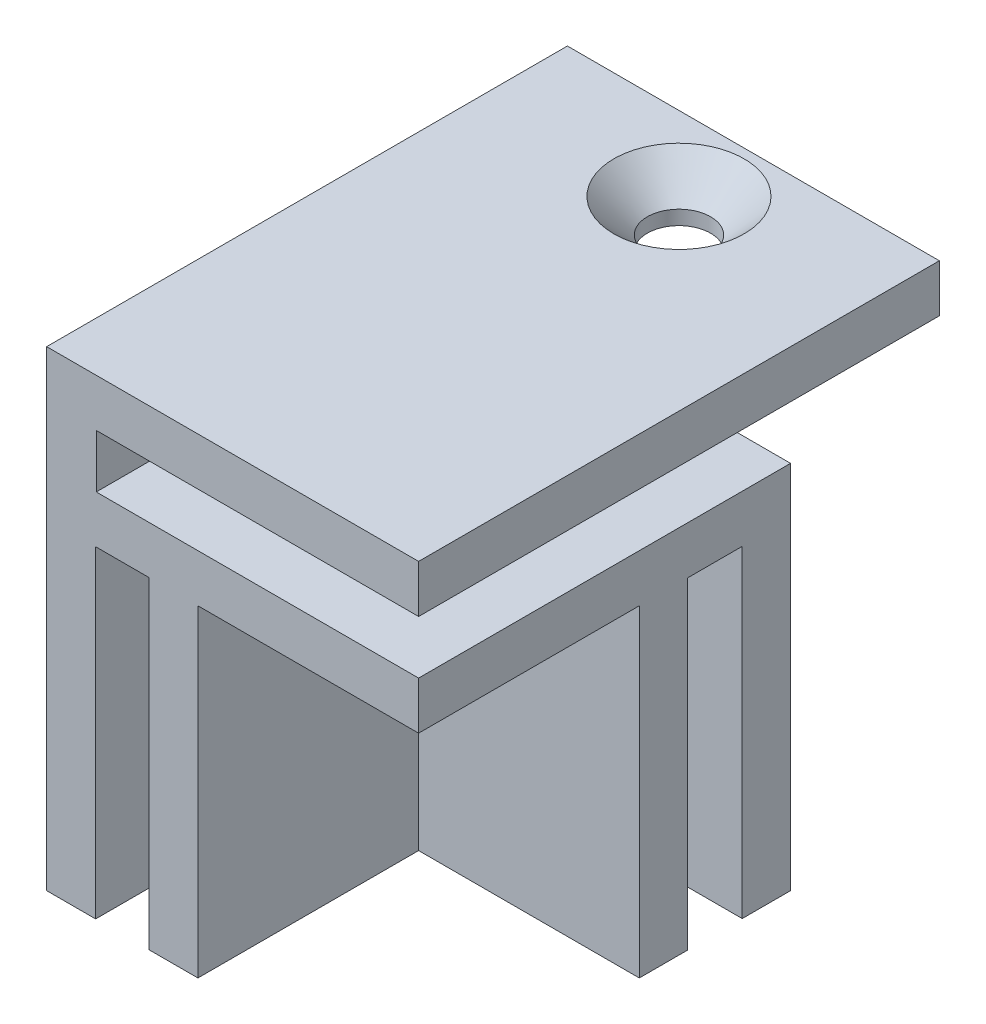
ISO-10303-21;
HEADER;
FILE_DESCRIPTION(('STEP AP214'),'2;1');
FILE_NAME('part.step','',(''),(''),'','','');
FILE_SCHEMA(('AUTOMOTIVE_DESIGN { 1 0 10303 214 1 1 1 1 }'));
ENDSEC;
DATA;
#1=APPLICATION_CONTEXT('core data for automotive mechanical design processes');
#2=APPLICATION_PROTOCOL_DEFINITION('international standard','automotive_design',2000,#1);
#3=PRODUCT_CONTEXT('',#1,'mechanical');
#4=PRODUCT('Part','Part','',(#3));
#5=PRODUCT_RELATED_PRODUCT_CATEGORY('part','',(#4));
#6=PRODUCT_DEFINITION_FORMATION('','',#4);
#7=PRODUCT_DEFINITION_CONTEXT('part definition',#1,'design');
#8=PRODUCT_DEFINITION('design','',#6,#7);
#9=PRODUCT_DEFINITION_SHAPE('','',#8);
#10=(LENGTH_UNIT() NAMED_UNIT(*) SI_UNIT(.MILLI.,.METRE.));
#11=(NAMED_UNIT(*) PLANE_ANGLE_UNIT() SI_UNIT($,.RADIAN.));
#12=(NAMED_UNIT(*) SI_UNIT($,.STERADIAN.) SOLID_ANGLE_UNIT());
#13=UNCERTAINTY_MEASURE_WITH_UNIT(LENGTH_MEASURE(1.E-05),#10,'distance_accuracy_value','');
#14=(GEOMETRIC_REPRESENTATION_CONTEXT(3) GLOBAL_UNCERTAINTY_ASSIGNED_CONTEXT((#13)) GLOBAL_UNIT_ASSIGNED_CONTEXT((#10,
#11,#12)) REPRESENTATION_CONTEXT('',''));
#15=CARTESIAN_POINT('',(0.,0.,0.));
#16=DIRECTION('',(0.,0.,1.));
#17=DIRECTION('',(1.,0.,0.));
#18=AXIS2_PLACEMENT_3D('',#15,#16,#17);
#19=CARTESIAN_POINT('',(-35.886738322403,38.,-13.5314685314684));
#20=DIRECTION('',(0.,0.,1.));
#21=DIRECTION('',(1.,0.,0.));
#22=AXIS2_PLACEMENT_3D('',#19,#20,#21);
#23=PLANE('',#22);
#24=DIRECTION('',(-1.,0.,0.));
#25=VECTOR('',#24,1.);
#26=CARTESIAN_POINT('',(-5.88673832240304,34.1499999999999,-13.5314685314684));
#27=LINE('',#26,#25);
#28=CARTESIAN_POINT('',(-31.886738322403,34.15,-13.5314685314684));
#29=VERTEX_POINT('',#28);
#30=CARTESIAN_POINT('',(-35.886738322403,34.1499999999999,-13.5314685314684));
#31=VERTEX_POINT('',#30);
#32=EDGE_CURVE('E11',#29,#31,#27,.T.);
#33=ORIENTED_EDGE('',*,*,#32,.F.);
#34=DIRECTION('',(0.,-1.,0.));
#35=VECTOR('',#34,1.);
#36=CARTESIAN_POINT('',(-31.886738322403,34.15,-13.5314685314684));
#37=LINE('',#36,#35);
#38=CARTESIAN_POINT('',(-31.886738322403,29.85,-13.5314685314684));
#39=VERTEX_POINT('',#38);
#40=EDGE_CURVE('E225',#29,#39,#37,.T.);
#41=ORIENTED_EDGE('',*,*,#40,.T.);
#42=DIRECTION('',(1.,0.,0.));
#43=VECTOR('',#42,1.);
#44=CARTESIAN_POINT('',(-31.886738322403,29.85,-13.5314685314684));
#45=LINE('',#44,#43);
#46=CARTESIAN_POINT('',(-5.88673832240304,29.85,-13.5314685314684));
#47=VERTEX_POINT('',#46);
#48=EDGE_CURVE('E229',#39,#47,#45,.T.);
#49=ORIENTED_EDGE('',*,*,#48,.T.);
#50=DIRECTION('',(0.,-1.,0.));
#51=VECTOR('',#50,1.);
#52=CARTESIAN_POINT('',(-5.88673832240304,38.,-13.5314685314684));
#53=LINE('',#52,#51);
#54=CARTESIAN_POINT('',(-5.88673832240304,0.,-13.5314685314684));
#55=VERTEX_POINT('',#54);
#56=EDGE_CURVE('E390',#47,#55,#53,.T.);
#57=ORIENTED_EDGE('',*,*,#56,.T.);
#58=DIRECTION('',(-1.,0.,0.));
#59=VECTOR('',#58,1.);
#60=CARTESIAN_POINT('',(-35.886738322403,0.,-13.5314685314684));
#61=LINE('',#60,#59);
#62=CARTESIAN_POINT('',(-35.886738322403,0.,-13.5314685314684));
#63=VERTEX_POINT('',#62);
#64=EDGE_CURVE('E365',#55,#63,#61,.T.);
#65=ORIENTED_EDGE('',*,*,#64,.T.);
#66=DIRECTION('',(0.,-1.,0.));
#67=VECTOR('',#66,1.);
#68=CARTESIAN_POINT('',(-35.886738322403,38.,-13.5314685314684));
#69=LINE('',#68,#67);
#70=EDGE_CURVE('E371',#31,#63,#69,.T.);
#71=ORIENTED_EDGE('',*,*,#70,.F.);
#72=EDGE_LOOP('',(#33,#41,#49,#57,#65,#71));
#73=FACE_BOUND('',#72,.T.);
#74=ADVANCED_FACE('F39',(#73),#23,.F.);
#75=CARTESIAN_POINT('',(-5.88673832240304,38.,-13.5314685314684));
#76=DIRECTION('',(-1.,0.,0.));
#77=DIRECTION('',(0.,0.,1.));
#78=AXIS2_PLACEMENT_3D('',#75,#76,#77);
#79=PLANE('',#78);
#80=DIRECTION('',(0.,-1.,0.));
#81=VECTOR('',#80,1.);
#82=CARTESIAN_POINT('',(-5.88673832240304,38.,16.4685314685316));
#83=LINE('',#82,#81);
#84=CARTESIAN_POINT('',(-5.88673832240304,38.,16.4685314685316));
#85=VERTEX_POINT('',#84);
#86=CARTESIAN_POINT('',(-5.88673832240304,34.15,16.4685314685316));
#87=VERTEX_POINT('',#86);
#88=EDGE_CURVE('E188',#85,#87,#83,.T.);
#89=ORIENTED_EDGE('',*,*,#88,.T.);
#90=DIRECTION('',(0.,0.,1.));
#91=VECTOR('',#90,1.);
#92=CARTESIAN_POINT('',(-5.88673832240304,34.15,-13.5314685314684));
#93=LINE('',#92,#91);
#94=CARTESIAN_POINT('',(-5.88673832240304,34.1499999999999,-25.5314685314684));
#95=VERTEX_POINT('',#94);
#96=EDGE_CURVE('E181',#95,#87,#93,.T.);
#97=ORIENTED_EDGE('',*,*,#96,.F.);
#98=DIRECTION('',(0.,-1.,0.));
#99=VECTOR('',#98,1.);
#100=CARTESIAN_POINT('',(-5.88673832240304,38.,-25.5314685314684));
#101=LINE('',#100,#99);
#102=CARTESIAN_POINT('',(-5.88673832240304,38.,-25.5314685314684));
#103=VERTEX_POINT('',#102);
#104=EDGE_CURVE('E186',#103,#95,#101,.T.);
#105=ORIENTED_EDGE('',*,*,#104,.F.);
#106=DIRECTION('',(0.,0.,-1.));
#107=VECTOR('',#106,1.);
#108=CARTESIAN_POINT('',(-5.88673832240304,38.,-13.5314685314684));
#109=LINE('',#108,#107);
#110=EDGE_CURVE('E368',#85,#103,#109,.T.);
#111=ORIENTED_EDGE('',*,*,#110,.F.);
#112=EDGE_LOOP('',(#89,#97,#105,#111));
#113=FACE_BOUND('',#112,.T.);
#114=ADVANCED_FACE('F183',(#113),#79,.F.);
#115=CARTESIAN_POINT('',(-35.886738322403,38.,-13.5314685314684));
#116=DIRECTION('',(1.,0.,0.));
#117=DIRECTION('',(0.,0.,-1.));
#118=AXIS2_PLACEMENT_3D('',#115,#116,#117);
#119=PLANE('',#118);
#120=DIRECTION('',(0.,0.,1.));
#121=VECTOR('',#120,1.);
#122=CARTESIAN_POINT('',(-35.886738322403,0.,-13.5314685314684));
#123=LINE('',#122,#121);
#124=CARTESIAN_POINT('',(-35.886738322403,0.,16.4685314685316));
#125=VERTEX_POINT('',#124);
#126=EDGE_CURVE('E282',#63,#125,#123,.T.);
#127=ORIENTED_EDGE('',*,*,#126,.T.);
#128=DIRECTION('',(0.,-1.,0.));
#129=VECTOR('',#128,1.);
#130=CARTESIAN_POINT('',(-35.886738322403,38.,16.4685314685316));
#131=LINE('',#130,#129);
#132=CARTESIAN_POINT('',(-35.886738322403,38.,16.4685314685316));
#133=VERTEX_POINT('',#132);
#134=EDGE_CURVE('E49',#133,#125,#131,.T.);
#135=ORIENTED_EDGE('',*,*,#134,.F.);
#136=DIRECTION('',(0.,0.,1.));
#137=VECTOR('',#136,1.);
#138=CARTESIAN_POINT('',(-35.886738322403,38.,-13.5314685314684));
#139=LINE('',#138,#137);
#140=CARTESIAN_POINT('',(-35.886738322403,38.,-25.5314685314684));
#141=VERTEX_POINT('',#140);
#142=EDGE_CURVE('E360',#141,#133,#139,.T.);
#143=ORIENTED_EDGE('',*,*,#142,.F.);
#144=DIRECTION('',(0.,1.,0.));
#145=VECTOR('',#144,1.);
#146=CARTESIAN_POINT('',(-35.886738322403,38.,-25.5314685314684));
#147=LINE('',#146,#145);
#148=CARTESIAN_POINT('',(-35.886738322403,34.1499999999999,-25.5314685314684));
#149=VERTEX_POINT('',#148);
#150=EDGE_CURVE('E204',#149,#141,#147,.T.);
#151=ORIENTED_EDGE('',*,*,#150,.F.);
#152=DIRECTION('',(0.,0.,1.));
#153=VECTOR('',#152,1.);
#154=CARTESIAN_POINT('',(-35.886738322403,34.1499999999999,-25.5314685314684));
#155=LINE('',#154,#153);
#156=EDGE_CURVE('E199',#149,#31,#155,.T.);
#157=ORIENTED_EDGE('',*,*,#156,.T.);
#158=ORIENTED_EDGE('',*,*,#70,.T.);
#159=EDGE_LOOP('',(#127,#135,#143,#151,#157,#158));
#160=FACE_BOUND('',#159,.T.);
#161=ADVANCED_FACE('F41',(#160),#119,.F.);
#162=CARTESIAN_POINT('',(-35.886738322403,38.,16.4685314685316));
#163=DIRECTION('',(0.,0.,-1.));
#164=DIRECTION('',(-1.,0.,0.));
#165=AXIS2_PLACEMENT_3D('',#162,#163,#164);
#166=PLANE('',#165);
#167=DIRECTION('',(0.,-1.,0.));
#168=VECTOR('',#167,1.);
#169=CARTESIAN_POINT('',(-31.886738322403,34.15,16.4685314685316));
#170=LINE('',#169,#168);
#171=CARTESIAN_POINT('',(-31.886738322403,34.15,16.4685314685316));
#172=VERTEX_POINT('',#171);
#173=CARTESIAN_POINT('',(-31.886738322403,29.85,16.4685314685316));
#174=VERTEX_POINT('',#173);
#175=EDGE_CURVE('E224',#172,#174,#170,.T.);
#176=ORIENTED_EDGE('',*,*,#175,.F.);
#177=DIRECTION('',(-1.,0.,0.));
#178=VECTOR('',#177,1.);
#179=CARTESIAN_POINT('',(-31.886738322403,34.15,16.4685314685316));
#180=LINE('',#179,#178);
#181=EDGE_CURVE('E230',#87,#172,#180,.T.);
#182=ORIENTED_EDGE('',*,*,#181,.F.);
#183=ORIENTED_EDGE('',*,*,#88,.F.);
#184=DIRECTION('',(1.,0.,0.));
#185=VECTOR('',#184,1.);
#186=CARTESIAN_POINT('',(-35.886738322403,38.,16.4685314685316));
#187=LINE('',#186,#185);
#188=EDGE_CURVE('E364',#133,#85,#187,.T.);
#189=ORIENTED_EDGE('',*,*,#188,.F.);
#190=ORIENTED_EDGE('',*,*,#134,.T.);
#191=DIRECTION('',(1.,0.,0.));
#192=VECTOR('',#191,1.);
#193=CARTESIAN_POINT('',(-35.886738322403,0.,16.4685314685316));
#194=LINE('',#193,#192);
#195=CARTESIAN_POINT('',(-31.936738322403,0.,16.4685314685316));
#196=VERTEX_POINT('',#195);
#197=EDGE_CURVE('E376',#125,#196,#194,.T.);
#198=ORIENTED_EDGE('',*,*,#197,.T.);
#199=DIRECTION('',(0.,-1.,0.));
#200=VECTOR('',#199,1.);
#201=CARTESIAN_POINT('',(-31.936738322403,26.,16.4685314685316));
#202=LINE('',#201,#200);
#203=CARTESIAN_POINT('',(-31.936738322403,26.,16.4685314685316));
#204=VERTEX_POINT('',#203);
#205=EDGE_CURVE('E325',#204,#196,#202,.T.);
#206=ORIENTED_EDGE('',*,*,#205,.F.);
#207=DIRECTION('',(-1.,0.,0.));
#208=VECTOR('',#207,1.);
#209=CARTESIAN_POINT('',(-27.6367383224031,26.,16.4685314685316));
#210=LINE('',#209,#208);
#211=CARTESIAN_POINT('',(-27.6367383224031,26.,16.4685314685316));
#212=VERTEX_POINT('',#211);
#213=EDGE_CURVE('E295',#212,#204,#210,.T.);
#214=ORIENTED_EDGE('',*,*,#213,.F.);
#215=DIRECTION('',(0.,-1.,0.));
#216=VECTOR('',#215,1.);
#217=CARTESIAN_POINT('',(-27.6367383224031,26.,16.4685314685316));
#218=LINE('',#217,#216);
#219=CARTESIAN_POINT('',(-27.6367383224031,0.,16.4685314685316));
#220=VERTEX_POINT('',#219);
#221=EDGE_CURVE('E308',#212,#220,#218,.T.);
#222=ORIENTED_EDGE('',*,*,#221,.T.);
#223=CARTESIAN_POINT('',(-23.686738322403,0.,16.4685314685316));
#224=VERTEX_POINT('',#223);
#225=EDGE_CURVE('E375',#220,#224,#194,.T.);
#226=ORIENTED_EDGE('',*,*,#225,.T.);
#227=DIRECTION('',(0.,-1.,0.));
#228=VECTOR('',#227,1.);
#229=CARTESIAN_POINT('',(-23.686738322403,26.,16.4685314685316));
#230=LINE('',#229,#228);
#231=CARTESIAN_POINT('',(-23.686738322403,26.,16.4685314685316));
#232=VERTEX_POINT('',#231);
#233=EDGE_CURVE('E65',#232,#224,#230,.T.);
#234=ORIENTED_EDGE('',*,*,#233,.F.);
#235=DIRECTION('',(-1.,0.,0.));
#236=VECTOR('',#235,1.);
#237=CARTESIAN_POINT('',(-5.88673832240304,26.,16.4685314685316));
#238=LINE('',#237,#236);
#239=CARTESIAN_POINT('',(-5.88673832240304,26.,16.4685314685316));
#240=VERTEX_POINT('',#239);
#241=EDGE_CURVE('E335',#240,#232,#238,.T.);
#242=ORIENTED_EDGE('',*,*,#241,.F.);
#243=CARTESIAN_POINT('',(-5.88673832240304,29.85,16.4685314685316));
#244=VERTEX_POINT('',#243);
#245=EDGE_CURVE('E393',#244,#240,#83,.T.);
#246=ORIENTED_EDGE('',*,*,#245,.F.);
#247=DIRECTION('',(1.,0.,0.));
#248=VECTOR('',#247,1.);
#249=CARTESIAN_POINT('',(-31.886738322403,29.85,16.4685314685316));
#250=LINE('',#249,#248);
#251=EDGE_CURVE('E237',#174,#244,#250,.T.);
#252=ORIENTED_EDGE('',*,*,#251,.F.);
#253=EDGE_LOOP('',(#176,#182,#183,#189,#190,#198,#206,#214,#222,#226,#234,#242,#246,#252));
#254=FACE_BOUND('',#253,.T.);
#255=ADVANCED_FACE('F400',(#254),#166,.F.);
#256=ORIENTED_EDGE('',*,*,#56,.F.);
#257=DIRECTION('',(0.,0.,1.));
#258=VECTOR('',#257,1.);
#259=CARTESIAN_POINT('',(-5.88673832240304,29.85,-13.5314685314684));
#260=LINE('',#259,#258);
#261=EDGE_CURVE('E57',#47,#244,#260,.T.);
#262=ORIENTED_EDGE('',*,*,#261,.T.);
#263=ORIENTED_EDGE('',*,*,#245,.T.);
#264=DIRECTION('',(0.,0.,1.));
#265=VECTOR('',#264,1.);
#266=CARTESIAN_POINT('',(-5.88673832240304,26.,16.4685314685316));
#267=LINE('',#266,#265);
#268=CARTESIAN_POINT('',(-5.88673832240304,26.,-1.33146853146841));
#269=VERTEX_POINT('',#268);
#270=EDGE_CURVE('E331',#269,#240,#267,.T.);
#271=ORIENTED_EDGE('',*,*,#270,.F.);
#272=DIRECTION('',(0.,-1.,0.));
#273=VECTOR('',#272,1.);
#274=CARTESIAN_POINT('',(-5.88673832240304,26.,-1.33146853146841));
#275=LINE('',#274,#273);
#276=CARTESIAN_POINT('',(-5.88673832240304,0.,-1.33146853146841));
#277=VERTEX_POINT('',#276);
#278=EDGE_CURVE('E313',#269,#277,#275,.T.);
#279=ORIENTED_EDGE('',*,*,#278,.T.);
#280=DIRECTION('',(0.,0.,-1.));
#281=VECTOR('',#280,1.);
#282=CARTESIAN_POINT('',(-5.88673832240304,0.,-13.5314685314684));
#283=LINE('',#282,#281);
#284=CARTESIAN_POINT('',(-5.88673832240304,0.,-5.23146853146841));
#285=VERTEX_POINT('',#284);
#286=EDGE_CURVE('E384',#277,#285,#283,.T.);
#287=ORIENTED_EDGE('',*,*,#286,.T.);
#288=DIRECTION('',(0.,-1.,0.));
#289=VECTOR('',#288,1.);
#290=CARTESIAN_POINT('',(-5.88673832240304,26.,-5.23146853146841));
#291=LINE('',#290,#289);
#292=CARTESIAN_POINT('',(-5.88673832240304,26.,-5.23146853146841));
#293=VERTEX_POINT('',#292);
#294=EDGE_CURVE('E266',#293,#285,#291,.T.);
#295=ORIENTED_EDGE('',*,*,#294,.F.);
#296=DIRECTION('',(0.,0.,1.));
#297=VECTOR('',#296,1.);
#298=CARTESIAN_POINT('',(-5.88673832240304,26.,-9.63146853146841));
#299=LINE('',#298,#297);
#300=CARTESIAN_POINT('',(-5.88673832240304,26.,-9.63146853146841));
#301=VERTEX_POINT('',#300);
#302=EDGE_CURVE('E249',#301,#293,#299,.T.);
#303=ORIENTED_EDGE('',*,*,#302,.F.);
#304=DIRECTION('',(0.,-1.,0.));
#305=VECTOR('',#304,1.);
#306=CARTESIAN_POINT('',(-5.88673832240304,26.,-9.63146853146841));
#307=LINE('',#306,#305);
#308=CARTESIAN_POINT('',(-5.88673832240304,0.,-9.63146853146841));
#309=VERTEX_POINT('',#308);
#310=EDGE_CURVE('E278',#301,#309,#307,.T.);
#311=ORIENTED_EDGE('',*,*,#310,.T.);
#312=EDGE_CURVE('E380',#309,#55,#283,.T.);
#313=ORIENTED_EDGE('',*,*,#312,.T.);
#314=EDGE_LOOP('',(#256,#262,#263,#271,#279,#287,#295,#303,#311,#313));
#315=FACE_BOUND('',#314,.T.);
#316=ADVANCED_FACE('F431',(#315),#79,.F.);
#317=CARTESIAN_POINT('',(0.,38.,0.));
#318=DIRECTION('',(0.,1.,0.));
#319=DIRECTION('',(0.,0.,1.));
#320=AXIS2_PLACEMENT_3D('',#317,#318,#319);
#321=PLANE('',#320);
#322=CARTESIAN_POINT('',(-20.886738322403,38.,-19.5314685314684));
#323=DIRECTION('',(0.,1.,0.));
#324=DIRECTION('',(0.,0.,1.));
#325=AXIS2_PLACEMENT_3D('',#322,#323,#324);
#326=CIRCLE('',#325,5.250000041);
#327=CARTESIAN_POINT('',(-20.886738322403,38.,-14.2814684904684));
#328=VERTEX_POINT('',#327);
#329=EDGE_CURVE('E676',#328,#328,#326,.T.);
#330=ORIENTED_EDGE('',*,*,#329,.F.);
#331=EDGE_LOOP('',(#330));
#332=FACE_BOUND('',#331,.T.);
#333=ORIENTED_EDGE('',*,*,#142,.T.);
#334=ORIENTED_EDGE('',*,*,#188,.T.);
#335=ORIENTED_EDGE('',*,*,#110,.T.);
#336=DIRECTION('',(1.,0.,0.));
#337=VECTOR('',#336,1.);
#338=CARTESIAN_POINT('',(-5.88673832240304,38.,-25.5314685314684));
#339=LINE('',#338,#337);
#340=EDGE_CURVE('E209',#141,#103,#339,.T.);
#341=ORIENTED_EDGE('',*,*,#340,.F.);
#342=EDGE_LOOP('',(#333,#334,#335,#341));
#343=FACE_BOUND('',#342,.T.);
#344=ADVANCED_FACE('F460',(#332,#343),#321,.T.);
#345=CARTESIAN_POINT('',(0.,0.,0.));
#346=DIRECTION('',(0.,1.,0.));
#347=DIRECTION('',(0.,0.,1.));
#348=AXIS2_PLACEMENT_3D('',#345,#346,#347);
#349=PLANE('',#348);
#350=ORIENTED_EDGE('',*,*,#312,.F.);
#351=DIRECTION('',(1.,0.,0.));
#352=VECTOR('',#351,1.);
#353=CARTESIAN_POINT('',(-5.88673832240304,0.,-9.63146853146841));
#354=LINE('',#353,#352);
#355=CARTESIAN_POINT('',(-23.686738322403,0.,-9.63146853146841));
#356=VERTEX_POINT('',#355);
#357=EDGE_CURVE('E254',#356,#309,#354,.T.);
#358=ORIENTED_EDGE('',*,*,#357,.F.);
#359=DIRECTION('',(0.,0.,-1.));
#360=VECTOR('',#359,1.);
#361=CARTESIAN_POINT('',(-23.686738322403,0.,-9.63146853146841));
#362=LINE('',#361,#360);
#363=CARTESIAN_POINT('',(-23.686738322403,0.,-5.23146853146841));
#364=VERTEX_POINT('',#363);
#365=EDGE_CURVE('E271',#364,#356,#362,.T.);
#366=ORIENTED_EDGE('',*,*,#365,.F.);
#367=DIRECTION('',(-1.,0.,0.));
#368=VECTOR('',#367,1.);
#369=CARTESIAN_POINT('',(-5.88673832240304,0.,-5.23146853146841));
#370=LINE('',#369,#368);
#371=EDGE_CURVE('E267',#285,#364,#370,.T.);
#372=ORIENTED_EDGE('',*,*,#371,.F.);
#373=ORIENTED_EDGE('',*,*,#286,.F.);
#374=DIRECTION('',(1.,0.,0.));
#375=VECTOR('',#374,1.);
#376=CARTESIAN_POINT('',(-5.88673832240304,0.,-1.33146853146841));
#377=LINE('',#376,#375);
#378=CARTESIAN_POINT('',(-23.686738322403,0.,-1.33146853146841));
#379=VERTEX_POINT('',#378);
#380=EDGE_CURVE('E336',#379,#277,#377,.T.);
#381=ORIENTED_EDGE('',*,*,#380,.F.);
#382=DIRECTION('',(0.,0.,-1.));
#383=VECTOR('',#382,1.);
#384=CARTESIAN_POINT('',(-23.686738322403,0.,16.4685314685316));
#385=LINE('',#384,#383);
#386=EDGE_CURVE('E243',#224,#379,#385,.T.);
#387=ORIENTED_EDGE('',*,*,#386,.F.);
#388=ORIENTED_EDGE('',*,*,#225,.F.);
#389=DIRECTION('',(0.,0.,1.));
#390=VECTOR('',#389,1.);
#391=CARTESIAN_POINT('',(-27.6367383224031,0.,16.4685314685316));
#392=LINE('',#391,#390);
#393=CARTESIAN_POINT('',(-27.6367383224031,0.,-1.33146853146841));
#394=VERTEX_POINT('',#393);
#395=EDGE_CURVE('E309',#394,#220,#392,.T.);
#396=ORIENTED_EDGE('',*,*,#395,.F.);
#397=DIRECTION('',(1.,0.,0.));
#398=VECTOR('',#397,1.);
#399=CARTESIAN_POINT('',(-27.6367383224031,0.,-1.33146853146841));
#400=LINE('',#399,#398);
#401=CARTESIAN_POINT('',(-31.936738322403,0.,-1.33146853146841));
#402=VERTEX_POINT('',#401);
#403=EDGE_CURVE('E296',#402,#394,#400,.T.);
#404=ORIENTED_EDGE('',*,*,#403,.F.);
#405=DIRECTION('',(0.,0.,-1.));
#406=VECTOR('',#405,1.);
#407=CARTESIAN_POINT('',(-31.936738322403,0.,16.4685314685316));
#408=LINE('',#407,#406);
#409=EDGE_CURVE('E312',#196,#402,#408,.T.);
#410=ORIENTED_EDGE('',*,*,#409,.F.);
#411=ORIENTED_EDGE('',*,*,#197,.F.);
#412=ORIENTED_EDGE('',*,*,#126,.F.);
#413=ORIENTED_EDGE('',*,*,#64,.F.);
#414=EDGE_LOOP('',(#350,#358,#366,#372,#373,#381,#387,#388,#396,#404,#410,#411,#412,#413));
#415=FACE_BOUND('',#414,.T.);
#416=ADVANCED_FACE('F407',(#415),#349,.F.);
#417=CARTESIAN_POINT('',(-5.88673832240304,26.,-1.33146853146841));
#418=DIRECTION('',(0.,0.,-1.));
#419=DIRECTION('',(-1.,0.,0.));
#420=AXIS2_PLACEMENT_3D('',#417,#418,#419);
#421=PLANE('',#420);
#422=ORIENTED_EDGE('',*,*,#380,.T.);
#423=ORIENTED_EDGE('',*,*,#278,.F.);
#424=DIRECTION('',(1.,0.,0.));
#425=VECTOR('',#424,1.);
#426=CARTESIAN_POINT('',(-5.88673832240304,26.,-1.33146853146841));
#427=LINE('',#426,#425);
#428=CARTESIAN_POINT('',(-23.686738322403,26.,-1.33146853146841));
#429=VERTEX_POINT('',#428);
#430=EDGE_CURVE('E344',#429,#269,#427,.T.);
#431=ORIENTED_EDGE('',*,*,#430,.F.);
#432=DIRECTION('',(0.,-1.,0.));
#433=VECTOR('',#432,1.);
#434=CARTESIAN_POINT('',(-23.686738322403,26.,-1.33146853146841));
#435=LINE('',#434,#433);
#436=EDGE_CURVE('E355',#429,#379,#435,.T.);
#437=ORIENTED_EDGE('',*,*,#436,.T.);
#438=EDGE_LOOP('',(#422,#423,#431,#437));
#439=FACE_BOUND('',#438,.T.);
#440=ADVANCED_FACE('F438',(#439),#421,.F.);
#441=CARTESIAN_POINT('',(-23.686738322403,26.,16.4685314685316));
#442=DIRECTION('',(-1.,0.,0.));
#443=DIRECTION('',(0.,0.,1.));
#444=AXIS2_PLACEMENT_3D('',#441,#442,#443);
#445=PLANE('',#444);
#446=ORIENTED_EDGE('',*,*,#386,.T.);
#447=ORIENTED_EDGE('',*,*,#436,.F.);
#448=DIRECTION('',(0.,0.,-1.));
#449=VECTOR('',#448,1.);
#450=CARTESIAN_POINT('',(-23.686738322403,26.,16.4685314685316));
#451=LINE('',#450,#449);
#452=EDGE_CURVE('E340',#232,#429,#451,.T.);
#453=ORIENTED_EDGE('',*,*,#452,.F.);
#454=ORIENTED_EDGE('',*,*,#233,.T.);
#455=EDGE_LOOP('',(#446,#447,#453,#454));
#456=FACE_BOUND('',#455,.T.);
#457=ADVANCED_FACE('F594',(#456),#445,.F.);
#458=CARTESIAN_POINT('',(0.,26.,0.));
#459=DIRECTION('',(0.,1.,0.));
#460=DIRECTION('',(0.,0.,1.));
#461=AXIS2_PLACEMENT_3D('',#458,#459,#460);
#462=PLANE('',#461);
#463=ORIENTED_EDGE('',*,*,#270,.T.);
#464=ORIENTED_EDGE('',*,*,#241,.T.);
#465=ORIENTED_EDGE('',*,*,#452,.T.);
#466=ORIENTED_EDGE('',*,*,#430,.T.);
#467=EDGE_LOOP('',(#463,#464,#465,#466));
#468=FACE_BOUND('',#467,.T.);
#469=ADVANCED_FACE('F435',(#468),#462,.F.);
#470=CARTESIAN_POINT('',(-27.6367383224031,26.,16.4685314685316));
#471=DIRECTION('',(1.,0.,0.));
#472=DIRECTION('',(0.,0.,-1.));
#473=AXIS2_PLACEMENT_3D('',#470,#471,#472);
#474=PLANE('',#473);
#475=ORIENTED_EDGE('',*,*,#395,.T.);
#476=ORIENTED_EDGE('',*,*,#221,.F.);
#477=DIRECTION('',(0.,0.,1.));
#478=VECTOR('',#477,1.);
#479=CARTESIAN_POINT('',(-27.6367383224031,26.,16.4685314685316));
#480=LINE('',#479,#478);
#481=CARTESIAN_POINT('',(-27.6367383224031,26.,-1.33146853146841));
#482=VERTEX_POINT('',#481);
#483=EDGE_CURVE('E291',#482,#212,#480,.T.);
#484=ORIENTED_EDGE('',*,*,#483,.F.);
#485=DIRECTION('',(0.,-1.,0.));
#486=VECTOR('',#485,1.);
#487=CARTESIAN_POINT('',(-27.6367383224031,26.,-1.33146853146841));
#488=LINE('',#487,#486);
#489=EDGE_CURVE('E272',#482,#394,#488,.T.);
#490=ORIENTED_EDGE('',*,*,#489,.T.);
#491=EDGE_LOOP('',(#475,#476,#484,#490));
#492=FACE_BOUND('',#491,.T.);
#493=ADVANCED_FACE('F421',(#492),#474,.F.);
#494=CARTESIAN_POINT('',(-27.6367383224031,26.,-1.33146853146841));
#495=DIRECTION('',(0.,0.,-1.));
#496=DIRECTION('',(-1.,0.,0.));
#497=AXIS2_PLACEMENT_3D('',#494,#495,#496);
#498=PLANE('',#497);
#499=ORIENTED_EDGE('',*,*,#403,.T.);
#500=ORIENTED_EDGE('',*,*,#489,.F.);
#501=DIRECTION('',(1.,0.,0.));
#502=VECTOR('',#501,1.);
#503=CARTESIAN_POINT('',(-27.6367383224031,26.,-1.33146853146841));
#504=LINE('',#503,#502);
#505=CARTESIAN_POINT('',(-31.936738322403,26.,-1.33146853146841));
#506=VERTEX_POINT('',#505);
#507=EDGE_CURVE('E304',#506,#482,#504,.T.);
#508=ORIENTED_EDGE('',*,*,#507,.F.);
#509=DIRECTION('',(0.,-1.,0.));
#510=VECTOR('',#509,1.);
#511=CARTESIAN_POINT('',(-31.936738322403,26.,-1.33146853146841));
#512=LINE('',#511,#510);
#513=EDGE_CURVE('E322',#506,#402,#512,.T.);
#514=ORIENTED_EDGE('',*,*,#513,.T.);
#515=EDGE_LOOP('',(#499,#500,#508,#514));
#516=FACE_BOUND('',#515,.T.);
#517=ADVANCED_FACE('F568',(#516),#498,.F.);
#518=CARTESIAN_POINT('',(-31.936738322403,26.,16.4685314685316));
#519=DIRECTION('',(-1.,0.,0.));
#520=DIRECTION('',(0.,0.,1.));
#521=AXIS2_PLACEMENT_3D('',#518,#519,#520);
#522=PLANE('',#521);
#523=ORIENTED_EDGE('',*,*,#409,.T.);
#524=ORIENTED_EDGE('',*,*,#513,.F.);
#525=DIRECTION('',(0.,0.,-1.));
#526=VECTOR('',#525,1.);
#527=CARTESIAN_POINT('',(-31.936738322403,26.,16.4685314685316));
#528=LINE('',#527,#526);
#529=EDGE_CURVE('E300',#204,#506,#528,.T.);
#530=ORIENTED_EDGE('',*,*,#529,.F.);
#531=ORIENTED_EDGE('',*,*,#205,.T.);
#532=EDGE_LOOP('',(#523,#524,#530,#531));
#533=FACE_BOUND('',#532,.T.);
#534=ADVANCED_FACE('F412',(#533),#522,.F.);
#535=CARTESIAN_POINT('',(0.,26.,0.));
#536=DIRECTION('',(0.,1.,0.));
#537=DIRECTION('',(0.,0.,1.));
#538=AXIS2_PLACEMENT_3D('',#535,#536,#537);
#539=PLANE('',#538);
#540=ORIENTED_EDGE('',*,*,#483,.T.);
#541=ORIENTED_EDGE('',*,*,#213,.T.);
#542=ORIENTED_EDGE('',*,*,#529,.T.);
#543=ORIENTED_EDGE('',*,*,#507,.T.);
#544=EDGE_LOOP('',(#540,#541,#542,#543));
#545=FACE_BOUND('',#544,.T.);
#546=ADVANCED_FACE('F417',(#545),#539,.F.);
#547=CARTESIAN_POINT('',(-5.88673832240304,26.,-9.63146853146841));
#548=DIRECTION('',(0.,0.,-1.));
#549=DIRECTION('',(-1.,0.,0.));
#550=AXIS2_PLACEMENT_3D('',#547,#548,#549);
#551=PLANE('',#550);
#552=ORIENTED_EDGE('',*,*,#357,.T.);
#553=ORIENTED_EDGE('',*,*,#310,.F.);
#554=DIRECTION('',(1.,0.,0.));
#555=VECTOR('',#554,1.);
#556=CARTESIAN_POINT('',(-5.88673832240304,26.,-9.63146853146841));
#557=LINE('',#556,#555);
#558=CARTESIAN_POINT('',(-23.686738322403,26.,-9.63146853146841));
#559=VERTEX_POINT('',#558);
#560=EDGE_CURVE('E262',#559,#301,#557,.T.);
#561=ORIENTED_EDGE('',*,*,#560,.F.);
#562=DIRECTION('',(0.,-1.,0.));
#563=VECTOR('',#562,1.);
#564=CARTESIAN_POINT('',(-23.686738322403,26.,-9.63146853146841));
#565=LINE('',#564,#563);
#566=EDGE_CURVE('E283',#559,#356,#565,.T.);
#567=ORIENTED_EDGE('',*,*,#566,.T.);
#568=EDGE_LOOP('',(#552,#553,#561,#567));
#569=FACE_BOUND('',#568,.T.);
#570=ADVANCED_FACE('F452',(#569),#551,.F.);
#571=CARTESIAN_POINT('',(-23.686738322403,26.,-9.63146853146841));
#572=DIRECTION('',(-1.,0.,0.));
#573=DIRECTION('',(0.,0.,1.));
#574=AXIS2_PLACEMENT_3D('',#571,#572,#573);
#575=PLANE('',#574);
#576=ORIENTED_EDGE('',*,*,#365,.T.);
#577=ORIENTED_EDGE('',*,*,#566,.F.);
#578=DIRECTION('',(0.,0.,-1.));
#579=VECTOR('',#578,1.);
#580=CARTESIAN_POINT('',(-23.686738322403,26.,-9.63146853146841));
#581=LINE('',#580,#579);
#582=CARTESIAN_POINT('',(-23.686738322403,26.,-5.23146853146841));
#583=VERTEX_POINT('',#582);
#584=EDGE_CURVE('E258',#583,#559,#581,.T.);
#585=ORIENTED_EDGE('',*,*,#584,.F.);
#586=DIRECTION('',(0.,-1.,0.));
#587=VECTOR('',#586,1.);
#588=CARTESIAN_POINT('',(-23.686738322403,26.,-5.23146853146841));
#589=LINE('',#588,#587);
#590=EDGE_CURVE('E286',#583,#364,#589,.T.);
#591=ORIENTED_EDGE('',*,*,#590,.T.);
#592=EDGE_LOOP('',(#576,#577,#585,#591));
#593=FACE_BOUND('',#592,.T.);
#594=ADVANCED_FACE('F534',(#593),#575,.F.);
#595=CARTESIAN_POINT('',(-5.88673832240304,26.,-5.23146853146841));
#596=DIRECTION('',(0.,0.,1.));
#597=DIRECTION('',(1.,0.,0.));
#598=AXIS2_PLACEMENT_3D('',#595,#596,#597);
#599=PLANE('',#598);
#600=ORIENTED_EDGE('',*,*,#371,.T.);
#601=ORIENTED_EDGE('',*,*,#590,.F.);
#602=DIRECTION('',(-1.,0.,0.));
#603=VECTOR('',#602,1.);
#604=CARTESIAN_POINT('',(-5.88673832240304,26.,-5.23146853146841));
#605=LINE('',#604,#603);
#606=EDGE_CURVE('E253',#293,#583,#605,.T.);
#607=ORIENTED_EDGE('',*,*,#606,.F.);
#608=ORIENTED_EDGE('',*,*,#294,.T.);
#609=EDGE_LOOP('',(#600,#601,#607,#608));
#610=FACE_BOUND('',#609,.T.);
#611=ADVANCED_FACE('F445',(#610),#599,.F.);
#612=CARTESIAN_POINT('',(0.,26.,0.));
#613=DIRECTION('',(0.,-1.,0.));
#614=DIRECTION('',(0.,0.,-1.));
#615=AXIS2_PLACEMENT_3D('',#612,#613,#614);
#616=PLANE('',#615);
#617=ORIENTED_EDGE('',*,*,#302,.T.);
#618=ORIENTED_EDGE('',*,*,#606,.T.);
#619=ORIENTED_EDGE('',*,*,#584,.T.);
#620=ORIENTED_EDGE('',*,*,#560,.T.);
#621=EDGE_LOOP('',(#617,#618,#619,#620));
#622=FACE_BOUND('',#621,.T.);
#623=ADVANCED_FACE('F449',(#622),#616,.T.);
#624=CARTESIAN_POINT('',(-31.886738322403,34.15,-13.5314685314684));
#625=DIRECTION('',(-1.,0.,0.));
#626=DIRECTION('',(0.,0.,1.));
#627=AXIS2_PLACEMENT_3D('',#624,#625,#626);
#628=PLANE('',#627);
#629=ORIENTED_EDGE('',*,*,#175,.T.);
#630=DIRECTION('',(0.,0.,1.));
#631=VECTOR('',#630,1.);
#632=CARTESIAN_POINT('',(-31.886738322403,29.85,-13.5314685314684));
#633=LINE('',#632,#631);
#634=EDGE_CURVE('E233',#39,#174,#633,.T.);
#635=ORIENTED_EDGE('',*,*,#634,.F.);
#636=ORIENTED_EDGE('',*,*,#40,.F.);
#637=DIRECTION('',(0.,0.,1.));
#638=VECTOR('',#637,1.);
#639=CARTESIAN_POINT('',(-31.886738322403,34.15,-13.5314685314684));
#640=LINE('',#639,#638);
#641=EDGE_CURVE('E193',#29,#172,#640,.T.);
#642=ORIENTED_EDGE('',*,*,#641,.T.);
#643=EDGE_LOOP('',(#629,#635,#636,#642));
#644=FACE_BOUND('',#643,.T.);
#645=ADVANCED_FACE('F457',(#644),#628,.F.);
#646=CARTESIAN_POINT('',(-31.886738322403,34.15,-13.5314685314684));
#647=DIRECTION('',(0.,1.,0.));
#648=DIRECTION('',(0.,0.,1.));
#649=AXIS2_PLACEMENT_3D('',#646,#647,#648);
#650=PLANE('',#649);
#651=CARTESIAN_POINT('',(-20.886738322403,34.15,-19.5314685314684));
#652=DIRECTION('',(0.,1.,0.));
#653=DIRECTION('',(0.,0.,1.));
#654=AXIS2_PLACEMENT_3D('',#651,#652,#653);
#655=CIRCLE('',#654,2.54999997999999);
#656=CARTESIAN_POINT('',(-20.886738322403,34.15,-16.9814685514684));
#657=VERTEX_POINT('',#656);
#658=EDGE_CURVE('E43',#657,#657,#655,.T.);
#659=ORIENTED_EDGE('',*,*,#658,.T.);
#660=EDGE_LOOP('',(#659));
#661=FACE_BOUND('',#660,.T.);
#662=ORIENTED_EDGE('',*,*,#181,.T.);
#663=ORIENTED_EDGE('',*,*,#641,.F.);
#664=ORIENTED_EDGE('',*,*,#32,.T.);
#665=ORIENTED_EDGE('',*,*,#156,.F.);
#666=DIRECTION('',(-1.,0.,0.));
#667=VECTOR('',#666,1.);
#668=CARTESIAN_POINT('',(-5.88673832240304,34.1499999999999,-25.5314685314684));
#669=LINE('',#668,#667);
#670=EDGE_CURVE('E196',#95,#149,#669,.T.);
#671=ORIENTED_EDGE('',*,*,#670,.F.);
#672=ORIENTED_EDGE('',*,*,#96,.T.);
#673=EDGE_LOOP('',(#662,#663,#664,#665,#671,#672));
#674=FACE_BOUND('',#673,.T.);
#675=ADVANCED_FACE('F197',(#661,#674),#650,.F.);
#676=CARTESIAN_POINT('',(-31.886738322403,29.85,-13.5314685314684));
#677=DIRECTION('',(0.,-1.,0.));
#678=DIRECTION('',(1.,0.,0.));
#679=AXIS2_PLACEMENT_3D('',#676,#677,#678);
#680=PLANE('',#679);
#681=ORIENTED_EDGE('',*,*,#251,.T.);
#682=ORIENTED_EDGE('',*,*,#261,.F.);
#683=ORIENTED_EDGE('',*,*,#48,.F.);
#684=ORIENTED_EDGE('',*,*,#634,.T.);
#685=EDGE_LOOP('',(#681,#682,#683,#684));
#686=FACE_BOUND('',#685,.T.);
#687=ADVANCED_FACE('F455',(#686),#680,.F.);
#688=CARTESIAN_POINT('',(0.,0.,-25.5314685314684));
#689=DIRECTION('',(0.,0.,-1.));
#690=DIRECTION('',(-1.,0.,0.));
#691=AXIS2_PLACEMENT_3D('',#688,#689,#690);
#692=PLANE('',#691);
#693=ORIENTED_EDGE('',*,*,#104,.T.);
#694=ORIENTED_EDGE('',*,*,#670,.T.);
#695=ORIENTED_EDGE('',*,*,#150,.T.);
#696=ORIENTED_EDGE('',*,*,#340,.T.);
#697=EDGE_LOOP('',(#693,#694,#695,#696));
#698=FACE_BOUND('',#697,.T.);
#699=ADVANCED_FACE('F207',(#698),#692,.T.);
#700=CARTESIAN_POINT('',(-20.886738322403,38.,-19.5314685314684));
#701=DIRECTION('',(0.,1.,0.));
#702=DIRECTION('',(0.,0.,1.));
#703=AXIS2_PLACEMENT_3D('',#700,#701,#702);
#704=CYLINDRICAL_SURFACE('',#703,2.54999997999999);
#705=CARTESIAN_POINT('',(-20.886738322403,35.299999939,-19.5314685314684));
#706=DIRECTION('',(0.,1.,0.));
#707=DIRECTION('',(0.,0.,1.));
#708=AXIS2_PLACEMENT_3D('',#705,#706,#707);
#709=CIRCLE('',#708,2.54999997999999);
#710=CARTESIAN_POINT('',(-20.886738322403,35.299999939,-16.9814685514684));
#711=VERTEX_POINT('',#710);
#712=EDGE_CURVE('E214',#711,#711,#709,.T.);
#713=ORIENTED_EDGE('',*,*,#712,.T.);
#714=EDGE_LOOP('',(#713));
#715=FACE_BOUND('',#714,.T.);
#716=ORIENTED_EDGE('',*,*,#658,.F.);
#717=EDGE_LOOP('',(#716));
#718=FACE_BOUND('',#717,.T.);
#719=ADVANCED_FACE('F643',(#715,#718),#704,.F.);
#720=CARTESIAN_POINT('',(-20.886738322403,38.,-19.5314685314684));
#721=DIRECTION('',(0.,1.,0.));
#722=DIRECTION('',(0.,0.,1.));
#723=AXIS2_PLACEMENT_3D('',#720,#721,#722);
#724=CONICAL_SURFACE('',#723,5.250000041,0.78539816339745);
#725=ORIENTED_EDGE('',*,*,#712,.F.);
#726=EDGE_LOOP('',(#725));
#727=FACE_BOUND('',#726,.T.);
#728=ORIENTED_EDGE('',*,*,#329,.T.);
#729=EDGE_LOOP('',(#728));
#730=FACE_BOUND('',#729,.T.);
#731=ADVANCED_FACE('F650',(#727,#730),#724,.F.);
#732=CLOSED_SHELL('',(#74,#114,#161,#255,#316,#344,#416,#440,#457,#469,#493,#517,#534,#546,#570,
#594,#611,#623,#645,#675,#687,#699,#719,#731));
#733=MANIFOLD_SOLID_BREP('B2',#732);
#734=ADVANCED_BREP_SHAPE_REPRESENTATION('',(#18,#733),#14);
#735=SHAPE_DEFINITION_REPRESENTATION(#9,#734);
ENDSEC;
END-ISO-10303-21;
